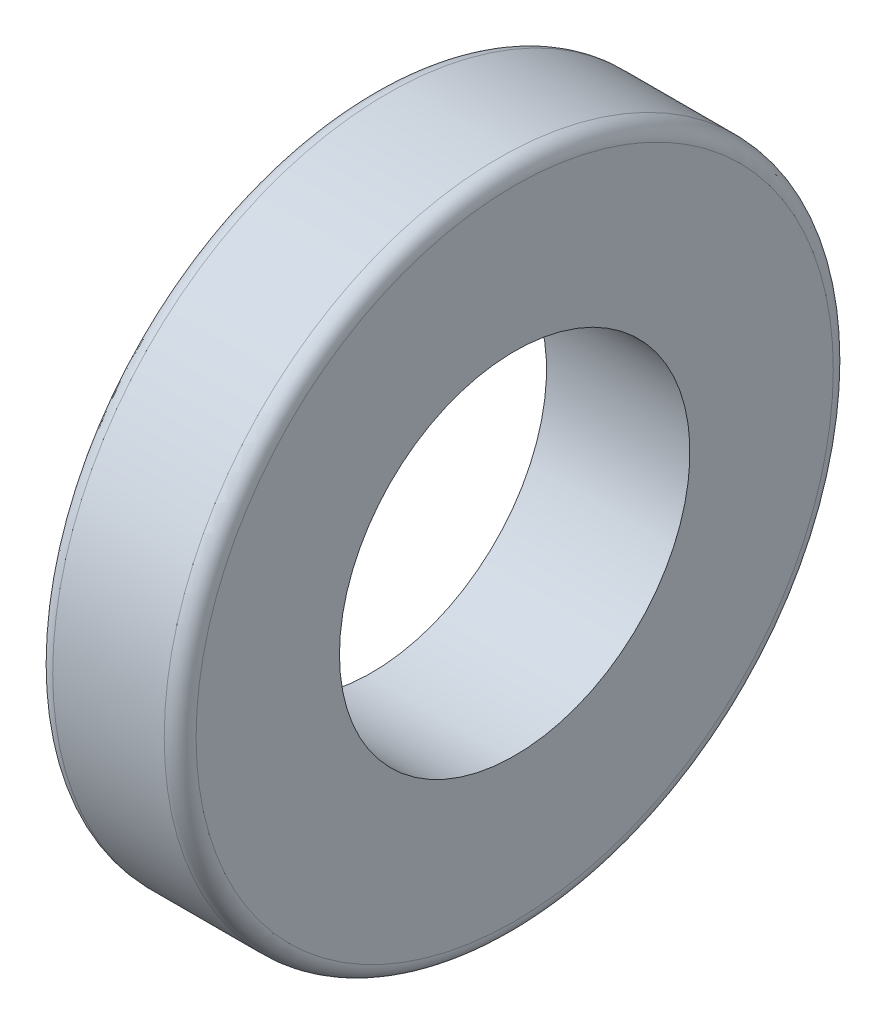
ISO-10303-21;
HEADER;
FILE_DESCRIPTION(('STEP AP214'),'2;1');
FILE_NAME('part.step','',(''),(''),'','','');
FILE_SCHEMA(('AUTOMOTIVE_DESIGN { 1 0 10303 214 1 1 1 1 }'));
ENDSEC;
DATA;
#1=APPLICATION_CONTEXT('core data for automotive mechanical design processes');
#2=APPLICATION_PROTOCOL_DEFINITION('international standard','automotive_design',2000,#1);
#3=PRODUCT_CONTEXT('',#1,'mechanical');
#4=PRODUCT('Part','Part','',(#3));
#5=PRODUCT_RELATED_PRODUCT_CATEGORY('part','',(#4));
#6=PRODUCT_DEFINITION_FORMATION('','',#4);
#7=PRODUCT_DEFINITION_CONTEXT('part definition',#1,'design');
#8=PRODUCT_DEFINITION('design','',#6,#7);
#9=PRODUCT_DEFINITION_SHAPE('','',#8);
#10=(LENGTH_UNIT() NAMED_UNIT(*) SI_UNIT(.MILLI.,.METRE.));
#11=(NAMED_UNIT(*) PLANE_ANGLE_UNIT() SI_UNIT($,.RADIAN.));
#12=(NAMED_UNIT(*) SI_UNIT($,.STERADIAN.) SOLID_ANGLE_UNIT());
#13=UNCERTAINTY_MEASURE_WITH_UNIT(LENGTH_MEASURE(1.E-05),#10,'distance_accuracy_value','');
#14=(GEOMETRIC_REPRESENTATION_CONTEXT(3) GLOBAL_UNCERTAINTY_ASSIGNED_CONTEXT((#13)) GLOBAL_UNIT_ASSIGNED_CONTEXT((#10,
#11,#12)) REPRESENTATION_CONTEXT('',''));
#15=CARTESIAN_POINT('',(0.,0.,0.));
#16=DIRECTION('',(0.,0.,1.));
#17=DIRECTION('',(1.,0.,0.));
#18=AXIS2_PLACEMENT_3D('',#15,#16,#17);
#19=CARTESIAN_POINT('',(0.,0.,0.));
#20=DIRECTION('',(-1.,0.,0.));
#21=DIRECTION('',(0.,0.,1.));
#22=AXIS2_PLACEMENT_3D('',#19,#20,#21);
#23=CYLINDRICAL_SURFACE('',#22,5.5);
#24=CARTESIAN_POINT('',(5.25,0.,0.));
#25=DIRECTION('',(-1.,0.,0.));
#26=DIRECTION('',(0.,0.,1.));
#27=AXIS2_PLACEMENT_3D('',#24,#25,#26);
#28=CIRCLE('',#27,5.5);
#29=CARTESIAN_POINT('',(5.25,0.,5.5));
#30=VERTEX_POINT('',#29);
#31=EDGE_CURVE('E65',#30,#30,#28,.T.);
#32=ORIENTED_EDGE('',*,*,#31,.F.);
#33=EDGE_LOOP('',(#32));
#34=FACE_BOUND('',#33,.T.);
#35=CARTESIAN_POINT('',(0.750000000000001,0.,0.));
#36=DIRECTION('',(-1.,0.,0.));
#37=DIRECTION('',(0.,0.,1.));
#38=AXIS2_PLACEMENT_3D('',#35,#36,#37);
#39=CIRCLE('',#38,5.5);
#40=CARTESIAN_POINT('',(0.750000000000001,0.,5.5));
#41=VERTEX_POINT('',#40);
#42=EDGE_CURVE('E61',#41,#41,#39,.T.);
#43=ORIENTED_EDGE('',*,*,#42,.T.);
#44=EDGE_LOOP('',(#43));
#45=FACE_BOUND('',#44,.T.);
#46=ADVANCED_FACE('F37',(#34,#45),#23,.F.);
#47=CARTESIAN_POINT('',(0.75,10.5,0.));
#48=DIRECTION('',(1.,0.,0.));
#49=DIRECTION('',(0.,0.,-1.));
#50=AXIS2_PLACEMENT_3D('',#47,#48,#49);
#51=PLANE('',#50);
#52=CARTESIAN_POINT('',(0.75,0.,0.));
#53=DIRECTION('',(1.,0.,0.));
#54=DIRECTION('',(0.,0.,-1.));
#55=AXIS2_PLACEMENT_3D('',#52,#53,#54);
#56=CIRCLE('',#55,10.);
#57=CARTESIAN_POINT('',(0.75,0.,-10.));
#58=VERTEX_POINT('',#57);
#59=EDGE_CURVE('E55',#58,#58,#56,.F.);
#60=ORIENTED_EDGE('',*,*,#59,.T.);
#61=EDGE_LOOP('',(#60));
#62=FACE_BOUND('',#61,.T.);
#63=ORIENTED_EDGE('',*,*,#42,.F.);
#64=EDGE_LOOP('',(#63));
#65=FACE_BOUND('',#64,.T.);
#66=ADVANCED_FACE('F74',(#62,#65),#51,.F.);
#67=CARTESIAN_POINT('',(0.,0.,0.));
#68=DIRECTION('',(-1.,0.,0.));
#69=DIRECTION('',(0.,0.,1.));
#70=AXIS2_PLACEMENT_3D('',#67,#68,#69);
#71=CYLINDRICAL_SURFACE('',#70,10.5);
#72=CARTESIAN_POINT('',(1.25,0.,0.));
#73=DIRECTION('',(1.,0.,0.));
#74=DIRECTION('',(0.,0.,-1.));
#75=AXIS2_PLACEMENT_3D('',#72,#73,#74);
#76=CIRCLE('',#75,10.5);
#77=CARTESIAN_POINT('',(1.25,0.,-10.5));
#78=VERTEX_POINT('',#77);
#79=EDGE_CURVE('E45',#78,#78,#76,.T.);
#80=ORIENTED_EDGE('',*,*,#79,.T.);
#81=EDGE_LOOP('',(#80));
#82=FACE_BOUND('',#81,.T.);
#83=CARTESIAN_POINT('',(4.75,0.,0.));
#84=DIRECTION('',(1.,0.,0.));
#85=DIRECTION('',(0.,0.,-1.));
#86=AXIS2_PLACEMENT_3D('',#83,#84,#85);
#87=CIRCLE('',#86,10.5);
#88=CARTESIAN_POINT('',(4.75,0.,-10.5));
#89=VERTEX_POINT('',#88);
#90=EDGE_CURVE('E50',#89,#89,#87,.F.);
#91=ORIENTED_EDGE('',*,*,#90,.T.);
#92=EDGE_LOOP('',(#91));
#93=FACE_BOUND('',#92,.T.);
#94=ADVANCED_FACE('F79',(#82,#93),#71,.T.);
#95=CARTESIAN_POINT('',(5.25,10.5,0.));
#96=DIRECTION('',(1.,0.,0.));
#97=DIRECTION('',(0.,0.,-1.));
#98=AXIS2_PLACEMENT_3D('',#95,#96,#97);
#99=PLANE('',#98);
#100=CARTESIAN_POINT('',(5.25,0.,0.));
#101=DIRECTION('',(1.,0.,0.));
#102=DIRECTION('',(0.,0.,-1.));
#103=AXIS2_PLACEMENT_3D('',#100,#101,#102);
#104=CIRCLE('',#103,10.);
#105=CARTESIAN_POINT('',(5.25,0.,-10.));
#106=VERTEX_POINT('',#105);
#107=EDGE_CURVE('E10',#106,#106,#104,.T.);
#108=ORIENTED_EDGE('',*,*,#107,.T.);
#109=EDGE_LOOP('',(#108));
#110=FACE_BOUND('',#109,.T.);
#111=ORIENTED_EDGE('',*,*,#31,.T.);
#112=EDGE_LOOP('',(#111));
#113=FACE_BOUND('',#112,.T.);
#114=ADVANCED_FACE('F70',(#110,#113),#99,.T.);
#115=CARTESIAN_POINT('',(1.25,0.,0.));
#116=DIRECTION('',(1.,0.,0.));
#117=DIRECTION('',(0.,0.,-1.));
#118=AXIS2_PLACEMENT_3D('',#115,#116,#117);
#119=TOROIDAL_SURFACE('',#118,10.,0.5);
#120=ORIENTED_EDGE('',*,*,#79,.F.);
#121=EDGE_LOOP('',(#120));
#122=FACE_BOUND('',#121,.T.);
#123=ORIENTED_EDGE('',*,*,#59,.F.);
#124=EDGE_LOOP('',(#123));
#125=FACE_BOUND('',#124,.T.);
#126=ADVANCED_FACE('F87',(#122,#125),#119,.T.);
#127=CARTESIAN_POINT('',(4.75,0.,0.));
#128=DIRECTION('',(1.,0.,0.));
#129=DIRECTION('',(0.,0.,-1.));
#130=AXIS2_PLACEMENT_3D('',#127,#128,#129);
#131=TOROIDAL_SURFACE('',#130,10.,0.5);
#132=ORIENTED_EDGE('',*,*,#107,.F.);
#133=EDGE_LOOP('',(#132));
#134=FACE_BOUND('',#133,.T.);
#135=ORIENTED_EDGE('',*,*,#90,.F.);
#136=EDGE_LOOP('',(#135));
#137=FACE_BOUND('',#136,.T.);
#138=ADVANCED_FACE('F39',(#134,#137),#131,.T.);
#139=CLOSED_SHELL('',(#46,#66,#94,#114,#126,#138));
#140=MANIFOLD_SOLID_BREP('B2',#139);
#141=ADVANCED_BREP_SHAPE_REPRESENTATION('',(#18,#140),#14);
#142=SHAPE_DEFINITION_REPRESENTATION(#9,#141);
ENDSEC;
END-ISO-10303-21;
